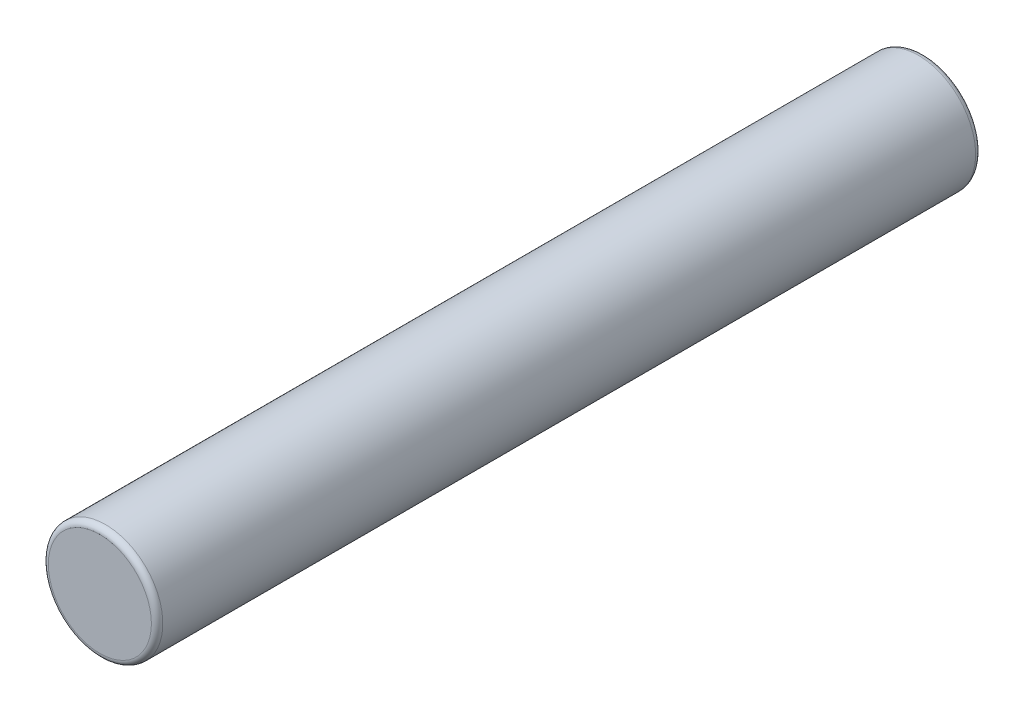
ISO-10303-21;
HEADER;
FILE_DESCRIPTION(('STEP AP214'),'2;1');
FILE_NAME('part.step','',(''),(''),'','','');
FILE_SCHEMA(('AUTOMOTIVE_DESIGN { 1 0 10303 214 1 1 1 1 }'));
ENDSEC;
DATA;
#1=APPLICATION_CONTEXT('core data for automotive mechanical design processes');
#2=APPLICATION_PROTOCOL_DEFINITION('international standard','automotive_design',2000,#1);
#3=PRODUCT_CONTEXT('',#1,'mechanical');
#4=PRODUCT('Part','Part','',(#3));
#5=PRODUCT_RELATED_PRODUCT_CATEGORY('part','',(#4));
#6=PRODUCT_DEFINITION_FORMATION('','',#4);
#7=PRODUCT_DEFINITION_CONTEXT('part definition',#1,'design');
#8=PRODUCT_DEFINITION('design','',#6,#7);
#9=PRODUCT_DEFINITION_SHAPE('','',#8);
#10=(LENGTH_UNIT() NAMED_UNIT(*) SI_UNIT(.MILLI.,.METRE.));
#11=(NAMED_UNIT(*) PLANE_ANGLE_UNIT() SI_UNIT($,.RADIAN.));
#12=(NAMED_UNIT(*) SI_UNIT($,.STERADIAN.) SOLID_ANGLE_UNIT());
#13=UNCERTAINTY_MEASURE_WITH_UNIT(LENGTH_MEASURE(1.E-05),#10,'distance_accuracy_value','');
#14=(GEOMETRIC_REPRESENTATION_CONTEXT(3) GLOBAL_UNCERTAINTY_ASSIGNED_CONTEXT((#13)) GLOBAL_UNIT_ASSIGNED_CONTEXT((#10,
#11,#12)) REPRESENTATION_CONTEXT('',''));
#15=CARTESIAN_POINT('',(0.,0.,0.));
#16=DIRECTION('',(0.,0.,1.));
#17=DIRECTION('',(1.,0.,0.));
#18=AXIS2_PLACEMENT_3D('',#15,#16,#17);
#19=CARTESIAN_POINT('',(0.,0.,14.4));
#20=DIRECTION('',(0.,0.,1.));
#21=DIRECTION('',(1.,0.,0.));
#22=AXIS2_PLACEMENT_3D('',#19,#20,#21);
#23=PLANE('',#22);
#24=CARTESIAN_POINT('',(0.,0.,14.4));
#25=DIRECTION('',(0.,0.,-1.));
#26=DIRECTION('',(-1.,0.,0.));
#27=AXIS2_PLACEMENT_3D('',#24,#25,#26);
#28=CIRCLE('',#27,0.900000000000001);
#29=CARTESIAN_POINT('',(-0.900000000000001,0.,14.4));
#30=VERTEX_POINT('',#29);
#31=CARTESIAN_POINT('',(0.900000000000001,0.,14.4));
#32=VERTEX_POINT('',#31);
#33=EDGE_CURVE('E49',#30,#32,#28,.T.);
#34=ORIENTED_EDGE('',*,*,#33,.F.);
#35=CARTESIAN_POINT('',(0.,0.,14.4));
#36=DIRECTION('',(0.,0.,-1.));
#37=DIRECTION('',(1.,0.,0.));
#38=AXIS2_PLACEMENT_3D('',#35,#36,#37);
#39=CIRCLE('',#38,0.900000000000001);
#40=EDGE_CURVE('E45',#32,#30,#39,.T.);
#41=ORIENTED_EDGE('',*,*,#40,.F.);
#42=EDGE_LOOP('',(#34,#41));
#43=FACE_BOUND('',#42,.T.);
#44=ADVANCED_FACE('F16',(#43),#23,.T.);
#45=CARTESIAN_POINT('',(0.,0.,0.));
#46=DIRECTION('',(0.,0.,1.));
#47=DIRECTION('',(1.,0.,0.));
#48=AXIS2_PLACEMENT_3D('',#45,#46,#47);
#49=PLANE('',#48);
#50=CARTESIAN_POINT('',(0.,0.,0.));
#51=DIRECTION('',(0.,0.,1.));
#52=DIRECTION('',(1.,0.,0.));
#53=AXIS2_PLACEMENT_3D('',#50,#51,#52);
#54=CIRCLE('',#53,0.900000000000001);
#55=CARTESIAN_POINT('',(0.900000000000001,0.,0.));
#56=VERTEX_POINT('',#55);
#57=CARTESIAN_POINT('',(-0.900000000000001,0.,0.));
#58=VERTEX_POINT('',#57);
#59=EDGE_CURVE('E56',#56,#58,#54,.T.);
#60=ORIENTED_EDGE('',*,*,#59,.F.);
#61=CARTESIAN_POINT('',(0.,0.,0.));
#62=DIRECTION('',(0.,0.,1.));
#63=DIRECTION('',(-1.,0.,0.));
#64=AXIS2_PLACEMENT_3D('',#61,#62,#63);
#65=CIRCLE('',#64,0.900000000000001);
#66=EDGE_CURVE('E36',#58,#56,#65,.T.);
#67=ORIENTED_EDGE('',*,*,#66,.F.);
#68=EDGE_LOOP('',(#60,#67));
#69=FACE_BOUND('',#68,.T.);
#70=ADVANCED_FACE('F74',(#69),#49,.F.);
#71=CARTESIAN_POINT('',(0.,0.,14.3));
#72=DIRECTION('',(0.,0.,1.));
#73=DIRECTION('',(1.,0.,0.));
#74=AXIS2_PLACEMENT_3D('',#71,#72,#73);
#75=TOROIDAL_SURFACE('',#74,0.900000000000001,0.1);
#76=ORIENTED_EDGE('',*,*,#40,.T.);
#77=ORIENTED_EDGE('',*,*,#33,.T.);
#78=EDGE_LOOP('',(#76,#77));
#79=FACE_BOUND('',#78,.T.);
#80=CARTESIAN_POINT('',(0.,0.,14.3));
#81=DIRECTION('',(0.,0.,-1.));
#82=DIRECTION('',(-1.,0.,0.));
#83=AXIS2_PLACEMENT_3D('',#80,#81,#82);
#84=CIRCLE('',#83,1.);
#85=CARTESIAN_POINT('',(-1.,0.,14.3));
#86=VERTEX_POINT('',#85);
#87=EDGE_CURVE('E28',#86,#86,#84,.T.);
#88=ORIENTED_EDGE('',*,*,#87,.F.);
#89=EDGE_LOOP('',(#88));
#90=FACE_BOUND('',#89,.T.);
#91=ADVANCED_FACE('F54',(#79,#90),#75,.T.);
#92=CARTESIAN_POINT('',(0.,0.,0.0999999999999994));
#93=DIRECTION('',(0.,0.,1.));
#94=DIRECTION('',(1.,0.,0.));
#95=AXIS2_PLACEMENT_3D('',#92,#93,#94);
#96=TOROIDAL_SURFACE('',#95,0.900000000000001,0.1);
#97=CARTESIAN_POINT('',(0.,0.,0.0999999999999994));
#98=DIRECTION('',(0.,0.,-1.));
#99=DIRECTION('',(-1.,0.,0.));
#100=AXIS2_PLACEMENT_3D('',#97,#98,#99);
#101=CIRCLE('',#100,1.);
#102=CARTESIAN_POINT('',(-1.,0.,0.0999999999999994));
#103=VERTEX_POINT('',#102);
#104=EDGE_CURVE('E11',#103,#103,#101,.F.);
#105=ORIENTED_EDGE('',*,*,#104,.F.);
#106=EDGE_LOOP('',(#105));
#107=FACE_BOUND('',#106,.T.);
#108=ORIENTED_EDGE('',*,*,#59,.T.);
#109=ORIENTED_EDGE('',*,*,#66,.T.);
#110=EDGE_LOOP('',(#108,#109));
#111=FACE_BOUND('',#110,.T.);
#112=ADVANCED_FACE('F73',(#107,#111),#96,.T.);
#113=CARTESIAN_POINT('',(0.,0.,14.4));
#114=DIRECTION('',(0.,0.,-1.));
#115=DIRECTION('',(-1.,0.,0.));
#116=AXIS2_PLACEMENT_3D('',#113,#114,#115);
#117=CYLINDRICAL_SURFACE('',#116,1.);
#118=ORIENTED_EDGE('',*,*,#104,.T.);
#119=EDGE_LOOP('',(#118));
#120=FACE_BOUND('',#119,.T.);
#121=ORIENTED_EDGE('',*,*,#87,.T.);
#122=EDGE_LOOP('',(#121));
#123=FACE_BOUND('',#122,.T.);
#124=ADVANCED_FACE('F119',(#120,#123),#117,.T.);
#125=CLOSED_SHELL('',(#44,#70,#91,#112,#124));
#126=MANIFOLD_SOLID_BREP('B1',#125);
#127=ADVANCED_BREP_SHAPE_REPRESENTATION('',(#18,#126),#14);
#128=SHAPE_DEFINITION_REPRESENTATION(#9,#127);
ENDSEC;
END-ISO-10303-21;
